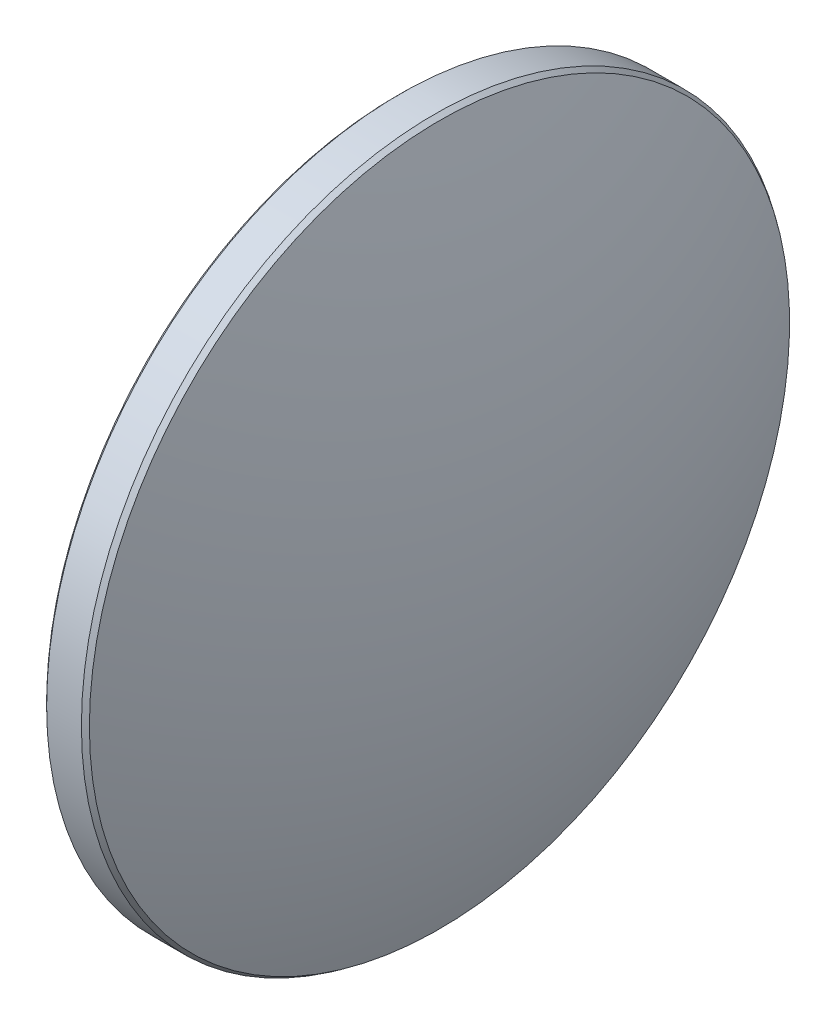
ISO-10303-21;
HEADER;
FILE_DESCRIPTION(('STEP AP214'),'2;1');
FILE_NAME('part.step','',(''),(''),'','','');
FILE_SCHEMA(('AUTOMOTIVE_DESIGN { 1 0 10303 214 1 1 1 1 }'));
ENDSEC;
DATA;
#1=APPLICATION_CONTEXT('core data for automotive mechanical design processes');
#2=APPLICATION_PROTOCOL_DEFINITION('international standard','automotive_design',2000,#1);
#3=PRODUCT_CONTEXT('',#1,'mechanical');
#4=PRODUCT('Part','Part','',(#3));
#5=PRODUCT_RELATED_PRODUCT_CATEGORY('part','',(#4));
#6=PRODUCT_DEFINITION_FORMATION('','',#4);
#7=PRODUCT_DEFINITION_CONTEXT('part definition',#1,'design');
#8=PRODUCT_DEFINITION('design','',#6,#7);
#9=PRODUCT_DEFINITION_SHAPE('','',#8);
#10=(LENGTH_UNIT() NAMED_UNIT(*) SI_UNIT(.MILLI.,.METRE.));
#11=(NAMED_UNIT(*) PLANE_ANGLE_UNIT() SI_UNIT($,.RADIAN.));
#12=(NAMED_UNIT(*) SI_UNIT($,.STERADIAN.) SOLID_ANGLE_UNIT());
#13=UNCERTAINTY_MEASURE_WITH_UNIT(LENGTH_MEASURE(1.E-05),#10,'distance_accuracy_value','');
#14=(GEOMETRIC_REPRESENTATION_CONTEXT(3) GLOBAL_UNCERTAINTY_ASSIGNED_CONTEXT((#13)) GLOBAL_UNIT_ASSIGNED_CONTEXT((#10,
#11,#12)) REPRESENTATION_CONTEXT('',''));
#15=CARTESIAN_POINT('',(0.,0.,0.));
#16=DIRECTION('',(0.,0.,1.));
#17=DIRECTION('',(1.,0.,0.));
#18=AXIS2_PLACEMENT_3D('',#15,#16,#17);
#19=CARTESIAN_POINT('',(-3.9,0.,0.));
#20=DIRECTION('',(1.,0.,0.));
#21=DIRECTION('',(0.,0.,-1.));
#22=AXIS2_PLACEMENT_3D('',#19,#20,#21);
#23=PLANE('',#22);
#24=CARTESIAN_POINT('',(-3.9,0.,0.));
#25=DIRECTION('',(1.,0.,0.));
#26=DIRECTION('',(0.,0.,-1.));
#27=AXIS2_PLACEMENT_3D('',#24,#25,#26);
#28=CIRCLE('',#27,25.15);
#29=CARTESIAN_POINT('',(-3.9,0.,-25.15));
#30=VERTEX_POINT('',#29);
#31=EDGE_CURVE('E10',#30,#30,#28,.F.);
#32=ORIENTED_EDGE('',*,*,#31,.T.);
#33=EDGE_LOOP('',(#32));
#34=FACE_BOUND('',#33,.T.);
#35=ADVANCED_FACE('F15',(#34),#23,.F.);
#36=CARTESIAN_POINT('',(-3.9,0.,0.));
#37=DIRECTION('',(-1.,0.,0.));
#38=DIRECTION('',(0.,0.,1.));
#39=AXIS2_PLACEMENT_3D('',#36,#37,#38);
#40=CYLINDRICAL_SURFACE('',#39,25.4);
#41=CARTESIAN_POINT('',(-1.15000000000046,0.,0.));
#42=DIRECTION('',(-1.,0.,0.));
#43=DIRECTION('',(0.,0.,1.));
#44=AXIS2_PLACEMENT_3D('',#41,#42,#43);
#45=CIRCLE('',#44,25.4);
#46=CARTESIAN_POINT('',(-1.15000000000046,0.,25.4));
#47=VERTEX_POINT('',#46);
#48=EDGE_CURVE('E55',#47,#47,#45,.T.);
#49=ORIENTED_EDGE('',*,*,#48,.T.);
#50=EDGE_LOOP('',(#49));
#51=FACE_BOUND('',#50,.T.);
#52=CARTESIAN_POINT('',(-3.65,0.,0.));
#53=DIRECTION('',(1.,0.,0.));
#54=DIRECTION('',(0.,0.,-1.));
#55=AXIS2_PLACEMENT_3D('',#52,#53,#54);
#56=CIRCLE('',#55,25.4);
#57=CARTESIAN_POINT('',(-3.65,0.,-25.4));
#58=VERTEX_POINT('',#57);
#59=EDGE_CURVE('E53',#58,#58,#56,.T.);
#60=ORIENTED_EDGE('',*,*,#59,.T.);
#61=EDGE_LOOP('',(#60));
#62=FACE_BOUND('',#61,.T.);
#63=ADVANCED_FACE('F28',(#51,#62),#40,.T.);
#64=CARTESIAN_POINT('',(-65.0999055100525,0.,0.114191084714488));
#65=DIRECTION('',(0.,-1.,0.));
#66=DIRECTION('',(0.,0.,1.));
#67=AXIS2_PLACEMENT_3D('',#64,#65,#66);
#68=CIRCLE('',#67,69.);
#69=TRIMMED_CURVE('',#68,(PARAMETER_VALUE(-1.57245127080707)),
(PARAMETER_VALUE(1.57245127080707)),.T.,.PARAMETER.);
#70=CARTESIAN_POINT('',(-65.0999055100525,0.,0.));
#71=DIRECTION('',(-1.,0.,0.));
#72=AXIS1_PLACEMENT('',#70,#71);
#73=SURFACE_OF_REVOLUTION('',#69,#72);
#74=CARTESIAN_POINT('',(-0.809046376240852,0.,0.));
#75=DIRECTION('',(-1.,0.,0.));
#76=DIRECTION('',(0.,0.,1.));
#77=AXIS2_PLACEMENT_3D('',#74,#75,#76);
#78=CIRCLE('',#77,25.1678421527004);
#79=CARTESIAN_POINT('',(-0.809046376240852,0.,25.1678421527004));
#80=VERTEX_POINT('',#79);
#81=EDGE_CURVE('E22',#80,#80,#78,.F.);
#82=ORIENTED_EDGE('',*,*,#81,.T.);
#83=EDGE_LOOP('',(#82));
#84=FACE_BOUND('',#83,.T.);
#85=CARTESIAN_POINT('',(3.9,0.,0.));
#86=VERTEX_POINT('',#85);
#87=VERTEX_LOOP('',#86);
#88=FACE_BOUND('',#87,.T.);
#89=ADVANCED_FACE('F25',(#84,#88),#73,.T.);
#90=CARTESIAN_POINT('',(-1.15000000000046,0.,0.));
#91=DIRECTION('',(-1.,0.,0.));
#92=DIRECTION('',(0.,0.,1.));
#93=AXIS2_PLACEMENT_3D('',#90,#91,#92);
#94=CONICAL_SURFACE('',#93,25.4,0.597796886848669);
#95=ORIENTED_EDGE('',*,*,#81,.F.);
#96=EDGE_LOOP('',(#95));
#97=FACE_BOUND('',#96,.T.);
#98=ORIENTED_EDGE('',*,*,#48,.F.);
#99=EDGE_LOOP('',(#98));
#100=FACE_BOUND('',#99,.T.);
#101=ADVANCED_FACE('F27',(#97,#100),#94,.T.);
#102=CARTESIAN_POINT('',(-3.9,0.,0.));
#103=DIRECTION('',(1.,0.,0.));
#104=DIRECTION('',(0.,0.,-1.));
#105=AXIS2_PLACEMENT_3D('',#102,#103,#104);
#106=CONICAL_SURFACE('',#105,25.15,0.785398163397448);
#107=ORIENTED_EDGE('',*,*,#59,.F.);
#108=EDGE_LOOP('',(#107));
#109=FACE_BOUND('',#108,.T.);
#110=ORIENTED_EDGE('',*,*,#31,.F.);
#111=EDGE_LOOP('',(#110));
#112=FACE_BOUND('',#111,.T.);
#113=ADVANCED_FACE('F17',(#109,#112),#106,.T.);
#114=CLOSED_SHELL('',(#35,#63,#89,#101,#113));
#115=MANIFOLD_SOLID_BREP('B1',#114);
#116=ADVANCED_BREP_SHAPE_REPRESENTATION('',(#18,#115),#14);
#117=SHAPE_DEFINITION_REPRESENTATION(#9,#116);
ENDSEC;
END-ISO-10303-21;
